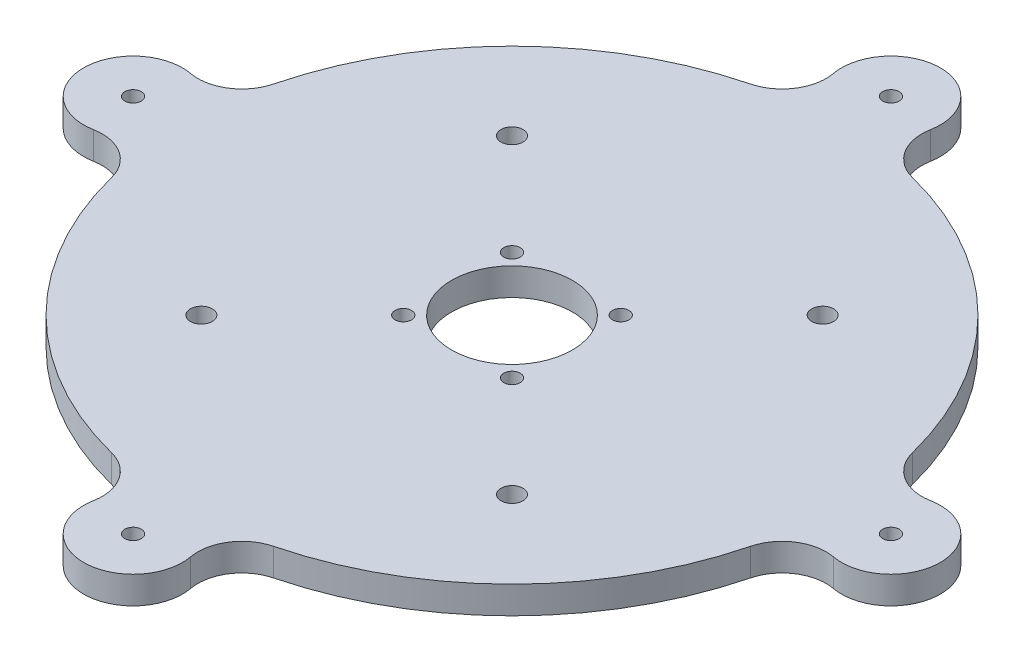
ISO-10303-21;
HEADER;
FILE_DESCRIPTION(('STEP AP214'),'2;1');
FILE_NAME('part.step','',(''),(''),'','','');
FILE_SCHEMA(('AUTOMOTIVE_DESIGN { 1 0 10303 214 1 1 1 1 }'));
ENDSEC;
DATA;
#1=APPLICATION_CONTEXT('core data for automotive mechanical design processes');
#2=APPLICATION_PROTOCOL_DEFINITION('international standard','automotive_design',2000,#1);
#3=PRODUCT_CONTEXT('',#1,'mechanical');
#4=PRODUCT('Part','Part','',(#3));
#5=PRODUCT_RELATED_PRODUCT_CATEGORY('part','',(#4));
#6=PRODUCT_DEFINITION_FORMATION('','',#4);
#7=PRODUCT_DEFINITION_CONTEXT('part definition',#1,'design');
#8=PRODUCT_DEFINITION('design','',#6,#7);
#9=PRODUCT_DEFINITION_SHAPE('','',#8);
#10=(LENGTH_UNIT() NAMED_UNIT(*) SI_UNIT(.MILLI.,.METRE.));
#11=(NAMED_UNIT(*) PLANE_ANGLE_UNIT() SI_UNIT($,.RADIAN.));
#12=(NAMED_UNIT(*) SI_UNIT($,.STERADIAN.) SOLID_ANGLE_UNIT());
#13=UNCERTAINTY_MEASURE_WITH_UNIT(LENGTH_MEASURE(1.E-05),#10,'distance_accuracy_value','');
#14=(GEOMETRIC_REPRESENTATION_CONTEXT(3) GLOBAL_UNCERTAINTY_ASSIGNED_CONTEXT((#13)) GLOBAL_UNIT_ASSIGNED_CONTEXT((#10,
#11,#12)) REPRESENTATION_CONTEXT('',''));
#15=CARTESIAN_POINT('',(0.,0.,0.));
#16=DIRECTION('',(0.,0.,1.));
#17=DIRECTION('',(1.,0.,0.));
#18=AXIS2_PLACEMENT_3D('',#15,#16,#17);
#19=CARTESIAN_POINT('',(16.7173771696678,5.,65.9130434782606));
#20=DIRECTION('',(0.,-1.,0.));
#21=DIRECTION('',(0.,0.,-1.));
#22=AXIS2_PLACEMENT_3D('',#19,#20,#21);
#23=CYLINDRICAL_SURFACE('',#22,7.99999999999999);
#24=CARTESIAN_POINT('',(16.7173771696678,0.,65.9130434782606));
#25=DIRECTION('',(0.,1.,0.));
#26=DIRECTION('',(0.,0.,1.));
#27=AXIS2_PLACEMENT_3D('',#24,#25,#26);
#28=CIRCLE('',#27,7.99999999999999);
#29=CARTESIAN_POINT('',(14.7506269144123,0.,58.1585677749359));
#30=VERTEX_POINT('',#29);
#31=CARTESIAN_POINT('',(8.85037614864767,0.,67.3657289002526));
#32=VERTEX_POINT('',#31);
#33=EDGE_CURVE('E218',#30,#32,#28,.T.);
#34=ORIENTED_EDGE('',*,*,#33,.F.);
#35=DIRECTION('',(0.,-1.,0.));
#36=VECTOR('',#35,1.);
#37=CARTESIAN_POINT('',(14.7506269144123,5.,58.1585677749359));
#38=LINE('',#37,#36);
#39=CARTESIAN_POINT('',(14.7506269144123,5.,58.1585677749359));
#40=VERTEX_POINT('',#39);
#41=EDGE_CURVE('E11',#40,#30,#38,.T.);
#42=ORIENTED_EDGE('',*,*,#41,.F.);
#43=CARTESIAN_POINT('',(16.7173771696678,5.,65.9130434782606));
#44=DIRECTION('',(0.,1.,0.));
#45=DIRECTION('',(0.,0.,1.));
#46=AXIS2_PLACEMENT_3D('',#43,#44,#45);
#47=CIRCLE('',#46,7.99999999999999);
#48=CARTESIAN_POINT('',(8.85037614864767,5.,67.3657289002526));
#49=VERTEX_POINT('',#48);
#50=EDGE_CURVE('E311',#40,#49,#47,.T.);
#51=ORIENTED_EDGE('',*,*,#50,.T.);
#52=DIRECTION('',(0.,-1.,0.));
#53=VECTOR('',#52,1.);
#54=CARTESIAN_POINT('',(8.85037614864767,5.,67.3657289002526));
#55=LINE('',#54,#53);
#56=EDGE_CURVE('E112',#49,#32,#55,.T.);
#57=ORIENTED_EDGE('',*,*,#56,.T.);
#58=EDGE_LOOP('',(#34,#42,#51,#57));
#59=FACE_BOUND('',#58,.T.);
#60=ADVANCED_FACE('F37',(#59),#23,.F.);
#61=CARTESIAN_POINT('',(0.,5.,0.));
#62=DIRECTION('',(0.,-1.,0.));
#63=DIRECTION('',(0.,0.,-1.));
#64=AXIS2_PLACEMENT_3D('',#61,#62,#63);
#65=CYLINDRICAL_SURFACE('',#64,60.);
#66=CARTESIAN_POINT('',(0.,0.,0.));
#67=DIRECTION('',(0.,1.,0.));
#68=DIRECTION('',(0.,0.,1.));
#69=AXIS2_PLACEMENT_3D('',#66,#67,#68);
#70=CIRCLE('',#69,60.);
#71=CARTESIAN_POINT('',(58.1585677749361,0.,14.7506269144118));
#72=VERTEX_POINT('',#71);
#73=EDGE_CURVE('E221',#30,#72,#70,.T.);
#74=ORIENTED_EDGE('',*,*,#73,.T.);
#75=DIRECTION('',(0.,-1.,0.));
#76=VECTOR('',#75,1.);
#77=CARTESIAN_POINT('',(58.1585677749361,5.,14.7506269144118));
#78=LINE('',#77,#76);
#79=CARTESIAN_POINT('',(58.1585677749361,5.,14.7506269144118));
#80=VERTEX_POINT('',#79);
#81=EDGE_CURVE('E46',#80,#72,#78,.T.);
#82=ORIENTED_EDGE('',*,*,#81,.F.);
#83=CARTESIAN_POINT('',(0.,5.,0.));
#84=DIRECTION('',(0.,1.,0.));
#85=DIRECTION('',(0.,0.,1.));
#86=AXIS2_PLACEMENT_3D('',#83,#84,#85);
#87=CIRCLE('',#86,60.);
#88=EDGE_CURVE('E309',#40,#80,#87,.T.);
#89=ORIENTED_EDGE('',*,*,#88,.F.);
#90=ORIENTED_EDGE('',*,*,#41,.T.);
#91=EDGE_LOOP('',(#74,#82,#89,#90));
#92=FACE_BOUND('',#91,.T.);
#93=ADVANCED_FACE('F294',(#92),#65,.T.);
#94=CARTESIAN_POINT('',(65.9130434782606,5.,16.7173771696678));
#95=DIRECTION('',(0.,-1.,0.));
#96=DIRECTION('',(0.,0.,-1.));
#97=AXIS2_PLACEMENT_3D('',#94,#95,#96);
#98=CYLINDRICAL_SURFACE('',#97,8.);
#99=CARTESIAN_POINT('',(65.9130434782606,0.,16.7173771696678));
#100=DIRECTION('',(0.,1.,0.));
#101=DIRECTION('',(0.,0.,1.));
#102=AXIS2_PLACEMENT_3D('',#99,#100,#101);
#103=CIRCLE('',#102,8.);
#104=CARTESIAN_POINT('',(67.3657289002527,0.,8.85037614864765));
#105=VERTEX_POINT('',#104);
#106=EDGE_CURVE('E224',#105,#72,#103,.T.);
#107=ORIENTED_EDGE('',*,*,#106,.F.);
#108=DIRECTION('',(0.,-1.,0.));
#109=VECTOR('',#108,1.);
#110=CARTESIAN_POINT('',(67.3657289002527,5.,8.85037614864765));
#111=LINE('',#110,#109);
#112=CARTESIAN_POINT('',(67.3657289002527,5.,8.85037614864765));
#113=VERTEX_POINT('',#112);
#114=EDGE_CURVE('E284',#113,#105,#111,.T.);
#115=ORIENTED_EDGE('',*,*,#114,.F.);
#116=CARTESIAN_POINT('',(65.9130434782606,5.,16.7173771696678));
#117=DIRECTION('',(0.,1.,0.));
#118=DIRECTION('',(0.,0.,1.));
#119=AXIS2_PLACEMENT_3D('',#116,#117,#118);
#120=CIRCLE('',#119,8.);
#121=EDGE_CURVE('E291',#113,#80,#120,.T.);
#122=ORIENTED_EDGE('',*,*,#121,.T.);
#123=ORIENTED_EDGE('',*,*,#81,.T.);
#124=EDGE_LOOP('',(#107,#115,#122,#123));
#125=FACE_BOUND('',#124,.T.);
#126=ADVANCED_FACE('F289',(#125),#98,.F.);
#127=CARTESIAN_POINT('',(68.9999999999937,5.,0.));
#128=DIRECTION('',(0.,-1.,0.));
#129=DIRECTION('',(0.,0.,-1.));
#130=AXIS2_PLACEMENT_3D('',#127,#128,#129);
#131=CYLINDRICAL_SURFACE('',#130,9.);
#132=CARTESIAN_POINT('',(68.9999999999937,0.,0.));
#133=DIRECTION('',(0.,1.,0.));
#134=DIRECTION('',(0.,0.,1.));
#135=AXIS2_PLACEMENT_3D('',#132,#133,#134);
#136=CIRCLE('',#135,9.);
#137=CARTESIAN_POINT('',(67.3657289002526,0.,-8.85037614864764));
#138=VERTEX_POINT('',#137);
#139=EDGE_CURVE('E227',#105,#138,#136,.T.);
#140=ORIENTED_EDGE('',*,*,#139,.T.);
#141=DIRECTION('',(0.,-1.,0.));
#142=VECTOR('',#141,1.);
#143=CARTESIAN_POINT('',(67.3657289002526,5.,-8.85037614864764));
#144=LINE('',#143,#142);
#145=CARTESIAN_POINT('',(67.3657289002526,5.,-8.85037614864764));
#146=VERTEX_POINT('',#145);
#147=EDGE_CURVE('E282',#146,#138,#144,.T.);
#148=ORIENTED_EDGE('',*,*,#147,.F.);
#149=CARTESIAN_POINT('',(68.9999999999937,5.,0.));
#150=DIRECTION('',(0.,1.,0.));
#151=DIRECTION('',(0.,0.,1.));
#152=AXIS2_PLACEMENT_3D('',#149,#150,#151);
#153=CIRCLE('',#152,9.);
#154=EDGE_CURVE('E305',#113,#146,#153,.T.);
#155=ORIENTED_EDGE('',*,*,#154,.F.);
#156=ORIENTED_EDGE('',*,*,#114,.T.);
#157=EDGE_LOOP('',(#140,#148,#155,#156));
#158=FACE_BOUND('',#157,.T.);
#159=ADVANCED_FACE('F302',(#158),#131,.T.);
#160=CARTESIAN_POINT('',(65.9130434782606,5.,-16.7173771696678));
#161=DIRECTION('',(0.,-1.,0.));
#162=DIRECTION('',(0.,0.,-1.));
#163=AXIS2_PLACEMENT_3D('',#160,#161,#162);
#164=CYLINDRICAL_SURFACE('',#163,7.99999999999999);
#165=CARTESIAN_POINT('',(65.9130434782606,0.,-16.7173771696678));
#166=DIRECTION('',(0.,1.,0.));
#167=DIRECTION('',(0.,0.,1.));
#168=AXIS2_PLACEMENT_3D('',#165,#166,#167);
#169=CIRCLE('',#168,7.99999999999999);
#170=CARTESIAN_POINT('',(58.1585677749359,0.,-14.7506269144123));
#171=VERTEX_POINT('',#170);
#172=EDGE_CURVE('E230',#171,#138,#169,.T.);
#173=ORIENTED_EDGE('',*,*,#172,.F.);
#174=DIRECTION('',(0.,-1.,0.));
#175=VECTOR('',#174,1.);
#176=CARTESIAN_POINT('',(58.1585677749359,5.,-14.7506269144123));
#177=LINE('',#176,#175);
#178=CARTESIAN_POINT('',(58.1585677749359,5.,-14.7506269144123));
#179=VERTEX_POINT('',#178);
#180=EDGE_CURVE('E280',#179,#171,#177,.T.);
#181=ORIENTED_EDGE('',*,*,#180,.F.);
#182=CARTESIAN_POINT('',(65.9130434782606,5.,-16.7173771696678));
#183=DIRECTION('',(0.,1.,0.));
#184=DIRECTION('',(0.,0.,1.));
#185=AXIS2_PLACEMENT_3D('',#182,#183,#184);
#186=CIRCLE('',#185,7.99999999999999);
#187=EDGE_CURVE('E307',#179,#146,#186,.T.);
#188=ORIENTED_EDGE('',*,*,#187,.T.);
#189=ORIENTED_EDGE('',*,*,#147,.T.);
#190=EDGE_LOOP('',(#173,#181,#188,#189));
#191=FACE_BOUND('',#190,.T.);
#192=ADVANCED_FACE('F544',(#191),#164,.F.);
#193=CARTESIAN_POINT('',(0.,5.,0.));
#194=DIRECTION('',(0.,-1.,0.));
#195=DIRECTION('',(0.,0.,-1.));
#196=AXIS2_PLACEMENT_3D('',#193,#194,#195);
#197=CYLINDRICAL_SURFACE('',#196,60.);
#198=CARTESIAN_POINT('',(0.,0.,0.));
#199=DIRECTION('',(0.,1.,0.));
#200=DIRECTION('',(0.,0.,1.));
#201=AXIS2_PLACEMENT_3D('',#198,#199,#200);
#202=CIRCLE('',#201,60.);
#203=CARTESIAN_POINT('',(14.7506269144124,0.,-58.1585677749359));
#204=VERTEX_POINT('',#203);
#205=EDGE_CURVE('E233',#171,#204,#202,.T.);
#206=ORIENTED_EDGE('',*,*,#205,.T.);
#207=DIRECTION('',(0.,-1.,0.));
#208=VECTOR('',#207,1.);
#209=CARTESIAN_POINT('',(14.7506269144124,5.,-58.1585677749359));
#210=LINE('',#209,#208);
#211=CARTESIAN_POINT('',(14.7506269144124,5.,-58.1585677749359));
#212=VERTEX_POINT('',#211);
#213=EDGE_CURVE('E278',#212,#204,#210,.T.);
#214=ORIENTED_EDGE('',*,*,#213,.F.);
#215=CARTESIAN_POINT('',(0.,5.,0.));
#216=DIRECTION('',(0.,1.,0.));
#217=DIRECTION('',(0.,0.,1.));
#218=AXIS2_PLACEMENT_3D('',#215,#216,#217);
#219=CIRCLE('',#218,60.);
#220=EDGE_CURVE('E316',#179,#212,#219,.T.);
#221=ORIENTED_EDGE('',*,*,#220,.F.);
#222=ORIENTED_EDGE('',*,*,#180,.T.);
#223=EDGE_LOOP('',(#206,#214,#221,#222));
#224=FACE_BOUND('',#223,.T.);
#225=ADVANCED_FACE('F540',(#224),#197,.T.);
#226=CARTESIAN_POINT('',(16.7173771696678,5.,-65.9130434782606));
#227=DIRECTION('',(0.,-1.,0.));
#228=DIRECTION('',(0.,0.,-1.));
#229=AXIS2_PLACEMENT_3D('',#226,#227,#228);
#230=CYLINDRICAL_SURFACE('',#229,8.00000000000001);
#231=CARTESIAN_POINT('',(16.7173771696678,0.,-65.9130434782606));
#232=DIRECTION('',(0.,1.,0.));
#233=DIRECTION('',(0.,0.,1.));
#234=AXIS2_PLACEMENT_3D('',#231,#232,#233);
#235=CIRCLE('',#234,8.00000000000001);
#236=CARTESIAN_POINT('',(8.85037614864764,0.,-67.3657289002526));
#237=VERTEX_POINT('',#236);
#238=EDGE_CURVE('E236',#237,#204,#235,.T.);
#239=ORIENTED_EDGE('',*,*,#238,.F.);
#240=DIRECTION('',(0.,-1.,0.));
#241=VECTOR('',#240,1.);
#242=CARTESIAN_POINT('',(8.85037614864764,5.,-67.3657289002526));
#243=LINE('',#242,#241);
#244=CARTESIAN_POINT('',(8.85037614864764,5.,-67.3657289002526));
#245=VERTEX_POINT('',#244);
#246=EDGE_CURVE('E276',#245,#237,#243,.T.);
#247=ORIENTED_EDGE('',*,*,#246,.F.);
#248=CARTESIAN_POINT('',(16.7173771696678,5.,-65.9130434782606));
#249=DIRECTION('',(0.,1.,0.));
#250=DIRECTION('',(0.,0.,1.));
#251=AXIS2_PLACEMENT_3D('',#248,#249,#250);
#252=CIRCLE('',#251,8.00000000000001);
#253=EDGE_CURVE('E318',#245,#212,#252,.T.);
#254=ORIENTED_EDGE('',*,*,#253,.T.);
#255=ORIENTED_EDGE('',*,*,#213,.T.);
#256=EDGE_LOOP('',(#239,#247,#254,#255));
#257=FACE_BOUND('',#256,.T.);
#258=ADVANCED_FACE('F536',(#257),#230,.F.);
#259=CARTESIAN_POINT('',(0.,5.,-68.9999999999937));
#260=DIRECTION('',(0.,-1.,0.));
#261=DIRECTION('',(0.,0.,-1.));
#262=AXIS2_PLACEMENT_3D('',#259,#260,#261);
#263=CYLINDRICAL_SURFACE('',#262,9.);
#264=CARTESIAN_POINT('',(0.,0.,-68.9999999999937));
#265=DIRECTION('',(0.,1.,0.));
#266=DIRECTION('',(0.,0.,1.));
#267=AXIS2_PLACEMENT_3D('',#264,#265,#266);
#268=CIRCLE('',#267,9.);
#269=CARTESIAN_POINT('',(-8.85037614864765,0.,-67.3657289002526));
#270=VERTEX_POINT('',#269);
#271=EDGE_CURVE('E239',#237,#270,#268,.T.);
#272=ORIENTED_EDGE('',*,*,#271,.T.);
#273=DIRECTION('',(0.,-1.,0.));
#274=VECTOR('',#273,1.);
#275=CARTESIAN_POINT('',(-8.85037614864765,5.,-67.3657289002526));
#276=LINE('',#275,#274);
#277=CARTESIAN_POINT('',(-8.85037614864765,5.,-67.3657289002526));
#278=VERTEX_POINT('',#277);
#279=EDGE_CURVE('E274',#278,#270,#276,.T.);
#280=ORIENTED_EDGE('',*,*,#279,.F.);
#281=CARTESIAN_POINT('',(0.,5.,-68.9999999999937));
#282=DIRECTION('',(0.,1.,0.));
#283=DIRECTION('',(0.,0.,1.));
#284=AXIS2_PLACEMENT_3D('',#281,#282,#283);
#285=CIRCLE('',#284,9.);
#286=EDGE_CURVE('E321',#245,#278,#285,.T.);
#287=ORIENTED_EDGE('',*,*,#286,.F.);
#288=ORIENTED_EDGE('',*,*,#246,.T.);
#289=EDGE_LOOP('',(#272,#280,#287,#288));
#290=FACE_BOUND('',#289,.T.);
#291=ADVANCED_FACE('F532',(#290),#263,.T.);
#292=CARTESIAN_POINT('',(-16.7173771696678,5.,-65.9130434782606));
#293=DIRECTION('',(0.,-1.,0.));
#294=DIRECTION('',(0.,0.,-1.));
#295=AXIS2_PLACEMENT_3D('',#292,#293,#294);
#296=CYLINDRICAL_SURFACE('',#295,7.99999999999998);
#297=CARTESIAN_POINT('',(-16.7173771696678,0.,-65.9130434782606));
#298=DIRECTION('',(0.,1.,0.));
#299=DIRECTION('',(0.,0.,1.));
#300=AXIS2_PLACEMENT_3D('',#297,#298,#299);
#301=CIRCLE('',#300,7.99999999999998);
#302=CARTESIAN_POINT('',(-14.7506269144123,0.,-58.1585677749359));
#303=VERTEX_POINT('',#302);
#304=EDGE_CURVE('E242',#303,#270,#301,.T.);
#305=ORIENTED_EDGE('',*,*,#304,.F.);
#306=DIRECTION('',(0.,-1.,0.));
#307=VECTOR('',#306,1.);
#308=CARTESIAN_POINT('',(-14.7506269144123,5.,-58.1585677749359));
#309=LINE('',#308,#307);
#310=CARTESIAN_POINT('',(-14.7506269144123,5.,-58.1585677749359));
#311=VERTEX_POINT('',#310);
#312=EDGE_CURVE('E272',#311,#303,#309,.T.);
#313=ORIENTED_EDGE('',*,*,#312,.F.);
#314=CARTESIAN_POINT('',(-16.7173771696678,5.,-65.9130434782606));
#315=DIRECTION('',(0.,1.,0.));
#316=DIRECTION('',(0.,0.,1.));
#317=AXIS2_PLACEMENT_3D('',#314,#315,#316);
#318=CIRCLE('',#317,7.99999999999998);
#319=EDGE_CURVE('E323',#311,#278,#318,.T.);
#320=ORIENTED_EDGE('',*,*,#319,.T.);
#321=ORIENTED_EDGE('',*,*,#279,.T.);
#322=EDGE_LOOP('',(#305,#313,#320,#321));
#323=FACE_BOUND('',#322,.T.);
#324=ADVANCED_FACE('F528',(#323),#296,.F.);
#325=CARTESIAN_POINT('',(0.,5.,0.));
#326=DIRECTION('',(0.,-1.,0.));
#327=DIRECTION('',(0.,0.,-1.));
#328=AXIS2_PLACEMENT_3D('',#325,#326,#327);
#329=CYLINDRICAL_SURFACE('',#328,60.);
#330=CARTESIAN_POINT('',(0.,0.,0.));
#331=DIRECTION('',(0.,1.,0.));
#332=DIRECTION('',(0.,0.,1.));
#333=AXIS2_PLACEMENT_3D('',#330,#331,#332);
#334=CIRCLE('',#333,60.);
#335=CARTESIAN_POINT('',(-58.158567774936,0.,-14.7506269144122));
#336=VERTEX_POINT('',#335);
#337=EDGE_CURVE('E245',#303,#336,#334,.T.);
#338=ORIENTED_EDGE('',*,*,#337,.T.);
#339=DIRECTION('',(0.,-1.,0.));
#340=VECTOR('',#339,1.);
#341=CARTESIAN_POINT('',(-58.158567774936,5.,-14.7506269144122));
#342=LINE('',#341,#340);
#343=CARTESIAN_POINT('',(-58.158567774936,5.,-14.7506269144122));
#344=VERTEX_POINT('',#343);
#345=EDGE_CURVE('E270',#344,#336,#342,.T.);
#346=ORIENTED_EDGE('',*,*,#345,.F.);
#347=CARTESIAN_POINT('',(0.,5.,0.));
#348=DIRECTION('',(0.,1.,0.));
#349=DIRECTION('',(0.,0.,1.));
#350=AXIS2_PLACEMENT_3D('',#347,#348,#349);
#351=CIRCLE('',#350,60.);
#352=EDGE_CURVE('E326',#311,#344,#351,.T.);
#353=ORIENTED_EDGE('',*,*,#352,.F.);
#354=ORIENTED_EDGE('',*,*,#312,.T.);
#355=EDGE_LOOP('',(#338,#346,#353,#354));
#356=FACE_BOUND('',#355,.T.);
#357=ADVANCED_FACE('F524',(#356),#329,.T.);
#358=CARTESIAN_POINT('',(-65.9130434782606,5.,-16.7173771696678));
#359=DIRECTION('',(0.,-1.,0.));
#360=DIRECTION('',(0.,0.,-1.));
#361=AXIS2_PLACEMENT_3D('',#358,#359,#360);
#362=CYLINDRICAL_SURFACE('',#361,7.99999999999999);
#363=CARTESIAN_POINT('',(-65.9130434782606,0.,-16.7173771696678));
#364=DIRECTION('',(0.,1.,0.));
#365=DIRECTION('',(0.,0.,1.));
#366=AXIS2_PLACEMENT_3D('',#363,#364,#365);
#367=CIRCLE('',#366,7.99999999999999);
#368=CARTESIAN_POINT('',(-67.3657289002526,0.,-8.85037614864764));
#369=VERTEX_POINT('',#368);
#370=EDGE_CURVE('E248',#369,#336,#367,.T.);
#371=ORIENTED_EDGE('',*,*,#370,.F.);
#372=DIRECTION('',(0.,-1.,0.));
#373=VECTOR('',#372,1.);
#374=CARTESIAN_POINT('',(-67.3657289002526,5.,-8.85037614864764));
#375=LINE('',#374,#373);
#376=CARTESIAN_POINT('',(-67.3657289002526,5.,-8.85037614864764));
#377=VERTEX_POINT('',#376);
#378=EDGE_CURVE('E268',#377,#369,#375,.T.);
#379=ORIENTED_EDGE('',*,*,#378,.F.);
#380=CARTESIAN_POINT('',(-65.9130434782606,5.,-16.7173771696678));
#381=DIRECTION('',(0.,1.,0.));
#382=DIRECTION('',(0.,0.,1.));
#383=AXIS2_PLACEMENT_3D('',#380,#381,#382);
#384=CIRCLE('',#383,7.99999999999999);
#385=EDGE_CURVE('E328',#377,#344,#384,.T.);
#386=ORIENTED_EDGE('',*,*,#385,.T.);
#387=ORIENTED_EDGE('',*,*,#345,.T.);
#388=EDGE_LOOP('',(#371,#379,#386,#387));
#389=FACE_BOUND('',#388,.T.);
#390=ADVANCED_FACE('F520',(#389),#362,.F.);
#391=CARTESIAN_POINT('',(-68.9999999999937,5.,0.));
#392=DIRECTION('',(0.,-1.,0.));
#393=DIRECTION('',(0.,0.,-1.));
#394=AXIS2_PLACEMENT_3D('',#391,#392,#393);
#395=CYLINDRICAL_SURFACE('',#394,9.);
#396=CARTESIAN_POINT('',(-68.9999999999937,0.,0.));
#397=DIRECTION('',(0.,1.,0.));
#398=DIRECTION('',(0.,0.,1.));
#399=AXIS2_PLACEMENT_3D('',#396,#397,#398);
#400=CIRCLE('',#399,9.);
#401=CARTESIAN_POINT('',(-67.3657289002526,0.,8.85037614864765));
#402=VERTEX_POINT('',#401);
#403=EDGE_CURVE('E251',#369,#402,#400,.T.);
#404=ORIENTED_EDGE('',*,*,#403,.T.);
#405=DIRECTION('',(0.,-1.,0.));
#406=VECTOR('',#405,1.);
#407=CARTESIAN_POINT('',(-67.3657289002526,5.,8.85037614864765));
#408=LINE('',#407,#406);
#409=CARTESIAN_POINT('',(-67.3657289002526,5.,8.85037614864765));
#410=VERTEX_POINT('',#409);
#411=EDGE_CURVE('E266',#410,#402,#408,.T.);
#412=ORIENTED_EDGE('',*,*,#411,.F.);
#413=CARTESIAN_POINT('',(-68.9999999999937,5.,0.));
#414=DIRECTION('',(0.,1.,0.));
#415=DIRECTION('',(0.,0.,1.));
#416=AXIS2_PLACEMENT_3D('',#413,#414,#415);
#417=CIRCLE('',#416,9.);
#418=EDGE_CURVE('E331',#377,#410,#417,.T.);
#419=ORIENTED_EDGE('',*,*,#418,.F.);
#420=ORIENTED_EDGE('',*,*,#378,.T.);
#421=EDGE_LOOP('',(#404,#412,#419,#420));
#422=FACE_BOUND('',#421,.T.);
#423=ADVANCED_FACE('F517',(#422),#395,.T.);
#424=CARTESIAN_POINT('',(-65.9130434782606,5.,16.7173771696678));
#425=DIRECTION('',(0.,-1.,0.));
#426=DIRECTION('',(0.,0.,-1.));
#427=AXIS2_PLACEMENT_3D('',#424,#425,#426);
#428=CYLINDRICAL_SURFACE('',#427,8.);
#429=CARTESIAN_POINT('',(-65.9130434782606,0.,16.7173771696678));
#430=DIRECTION('',(0.,1.,0.));
#431=DIRECTION('',(0.,0.,1.));
#432=AXIS2_PLACEMENT_3D('',#429,#430,#431);
#433=CIRCLE('',#432,8.);
#434=CARTESIAN_POINT('',(-58.1585677749359,0.,14.7506269144123));
#435=VERTEX_POINT('',#434);
#436=EDGE_CURVE('E254',#435,#402,#433,.T.);
#437=ORIENTED_EDGE('',*,*,#436,.F.);
#438=DIRECTION('',(0.,-1.,0.));
#439=VECTOR('',#438,1.);
#440=CARTESIAN_POINT('',(-58.1585677749359,5.,14.7506269144123));
#441=LINE('',#440,#439);
#442=CARTESIAN_POINT('',(-58.1585677749359,5.,14.7506269144123));
#443=VERTEX_POINT('',#442);
#444=EDGE_CURVE('E172',#443,#435,#441,.T.);
#445=ORIENTED_EDGE('',*,*,#444,.F.);
#446=CARTESIAN_POINT('',(-65.9130434782606,5.,16.7173771696678));
#447=DIRECTION('',(0.,1.,0.));
#448=DIRECTION('',(0.,0.,1.));
#449=AXIS2_PLACEMENT_3D('',#446,#447,#448);
#450=CIRCLE('',#449,8.);
#451=EDGE_CURVE('E161',#443,#410,#450,.T.);
#452=ORIENTED_EDGE('',*,*,#451,.T.);
#453=ORIENTED_EDGE('',*,*,#411,.T.);
#454=EDGE_LOOP('',(#437,#445,#452,#453));
#455=FACE_BOUND('',#454,.T.);
#456=ADVANCED_FACE('F334',(#455),#428,.F.);
#457=CARTESIAN_POINT('',(0.,5.,0.));
#458=DIRECTION('',(0.,-1.,0.));
#459=DIRECTION('',(0.,0.,-1.));
#460=AXIS2_PLACEMENT_3D('',#457,#458,#459);
#461=CYLINDRICAL_SURFACE('',#460,60.);
#462=CARTESIAN_POINT('',(0.,0.,0.));
#463=DIRECTION('',(0.,1.,0.));
#464=DIRECTION('',(0.,0.,1.));
#465=AXIS2_PLACEMENT_3D('',#462,#463,#464);
#466=CIRCLE('',#465,60.);
#467=CARTESIAN_POINT('',(-14.750626914412,0.,58.158567774936));
#468=VERTEX_POINT('',#467);
#469=EDGE_CURVE('E168',#435,#468,#466,.T.);
#470=ORIENTED_EDGE('',*,*,#469,.T.);
#471=DIRECTION('',(0.,-1.,0.));
#472=VECTOR('',#471,1.);
#473=CARTESIAN_POINT('',(-14.750626914412,5.,58.158567774936));
#474=LINE('',#473,#472);
#475=CARTESIAN_POINT('',(-14.750626914412,5.,58.158567774936));
#476=VERTEX_POINT('',#475);
#477=EDGE_CURVE('E165',#476,#468,#474,.T.);
#478=ORIENTED_EDGE('',*,*,#477,.F.);
#479=CARTESIAN_POINT('',(0.,5.,0.));
#480=DIRECTION('',(0.,1.,0.));
#481=DIRECTION('',(0.,0.,1.));
#482=AXIS2_PLACEMENT_3D('',#479,#480,#481);
#483=CIRCLE('',#482,60.);
#484=EDGE_CURVE('E155',#443,#476,#483,.T.);
#485=ORIENTED_EDGE('',*,*,#484,.F.);
#486=ORIENTED_EDGE('',*,*,#444,.T.);
#487=EDGE_LOOP('',(#470,#478,#485,#486));
#488=FACE_BOUND('',#487,.T.);
#489=ADVANCED_FACE('F166',(#488),#461,.T.);
#490=CARTESIAN_POINT('',(-16.7173771696678,5.,65.9130434782606));
#491=DIRECTION('',(0.,-1.,0.));
#492=DIRECTION('',(0.,0.,-1.));
#493=AXIS2_PLACEMENT_3D('',#490,#491,#492);
#494=CYLINDRICAL_SURFACE('',#493,8.00000000000001);
#495=CARTESIAN_POINT('',(-16.7173771696678,0.,65.9130434782606));
#496=DIRECTION('',(0.,1.,0.));
#497=DIRECTION('',(0.,0.,1.));
#498=AXIS2_PLACEMENT_3D('',#495,#496,#497);
#499=CIRCLE('',#498,8.00000000000001);
#500=CARTESIAN_POINT('',(-8.85037614864762,0.,67.3657289002526));
#501=VERTEX_POINT('',#500);
#502=EDGE_CURVE('E258',#501,#468,#499,.T.);
#503=ORIENTED_EDGE('',*,*,#502,.F.);
#504=DIRECTION('',(0.,-1.,0.));
#505=VECTOR('',#504,1.);
#506=CARTESIAN_POINT('',(-8.85037614864762,5.,67.3657289002526));
#507=LINE('',#506,#505);
#508=CARTESIAN_POINT('',(-8.85037614864762,5.,67.3657289002526));
#509=VERTEX_POINT('',#508);
#510=EDGE_CURVE('E105',#509,#501,#507,.T.);
#511=ORIENTED_EDGE('',*,*,#510,.F.);
#512=CARTESIAN_POINT('',(-16.7173771696678,5.,65.9130434782606));
#513=DIRECTION('',(0.,1.,0.));
#514=DIRECTION('',(0.,0.,1.));
#515=AXIS2_PLACEMENT_3D('',#512,#513,#514);
#516=CIRCLE('',#515,8.00000000000001);
#517=EDGE_CURVE('E159',#509,#476,#516,.T.);
#518=ORIENTED_EDGE('',*,*,#517,.T.);
#519=ORIENTED_EDGE('',*,*,#477,.T.);
#520=EDGE_LOOP('',(#503,#511,#518,#519));
#521=FACE_BOUND('',#520,.T.);
#522=ADVANCED_FACE('F174',(#521),#494,.F.);
#523=CARTESIAN_POINT('',(-28.2842712474619,5.,-28.2842712474618));
#524=DIRECTION('',(0.,-1.,0.));
#525=DIRECTION('',(0.,0.,-1.));
#526=AXIS2_PLACEMENT_3D('',#523,#524,#525);
#527=CYLINDRICAL_SURFACE('',#526,2.00000000000019);
#528=CARTESIAN_POINT('',(-28.2842712474619,5.,-28.2842712474618));
#529=DIRECTION('',(0.,1.,0.));
#530=DIRECTION('',(0.,0.,1.));
#531=AXIS2_PLACEMENT_3D('',#528,#529,#530);
#532=CIRCLE('',#531,2.00000000000019);
#533=CARTESIAN_POINT('',(-28.2842712474619,5.,-26.2842712474617));
#534=VERTEX_POINT('',#533);
#535=EDGE_CURVE('E338',#534,#534,#532,.T.);
#536=ORIENTED_EDGE('',*,*,#535,.T.);
#537=EDGE_LOOP('',(#536));
#538=FACE_BOUND('',#537,.T.);
#539=CARTESIAN_POINT('',(-28.2842712474619,0.,-28.2842712474618));
#540=DIRECTION('',(0.,1.,0.));
#541=DIRECTION('',(0.,0.,1.));
#542=AXIS2_PLACEMENT_3D('',#539,#540,#541);
#543=CIRCLE('',#542,2.00000000000019);
#544=CARTESIAN_POINT('',(-28.2842712474619,0.,-26.2842712474617));
#545=VERTEX_POINT('',#544);
#546=EDGE_CURVE('E215',#545,#545,#543,.T.);
#547=ORIENTED_EDGE('',*,*,#546,.F.);
#548=EDGE_LOOP('',(#547));
#549=FACE_BOUND('',#548,.T.);
#550=ADVANCED_FACE('F407',(#538,#549),#527,.F.);
#551=CARTESIAN_POINT('',(-28.2842712474619,5.,28.2842712474619));
#552=DIRECTION('',(0.,-1.,0.));
#553=DIRECTION('',(0.,0.,-1.));
#554=AXIS2_PLACEMENT_3D('',#551,#552,#553);
#555=CYLINDRICAL_SURFACE('',#554,2.00000000000009);
#556=CARTESIAN_POINT('',(-28.2842712474619,5.,28.2842712474619));
#557=DIRECTION('',(0.,1.,0.));
#558=DIRECTION('',(0.,0.,1.));
#559=AXIS2_PLACEMENT_3D('',#556,#557,#558);
#560=CIRCLE('',#559,2.00000000000009);
#561=CARTESIAN_POINT('',(-28.2842712474619,5.,30.284271247462));
#562=VERTEX_POINT('',#561);
#563=EDGE_CURVE('E340',#562,#562,#560,.T.);
#564=ORIENTED_EDGE('',*,*,#563,.T.);
#565=EDGE_LOOP('',(#564));
#566=FACE_BOUND('',#565,.T.);
#567=CARTESIAN_POINT('',(-28.2842712474619,0.,28.2842712474619));
#568=DIRECTION('',(0.,1.,0.));
#569=DIRECTION('',(0.,0.,1.));
#570=AXIS2_PLACEMENT_3D('',#567,#568,#569);
#571=CIRCLE('',#570,2.00000000000009);
#572=CARTESIAN_POINT('',(-28.2842712474619,0.,30.284271247462));
#573=VERTEX_POINT('',#572);
#574=EDGE_CURVE('E212',#573,#573,#571,.T.);
#575=ORIENTED_EDGE('',*,*,#574,.F.);
#576=EDGE_LOOP('',(#575));
#577=FACE_BOUND('',#576,.T.);
#578=ADVANCED_FACE('F410',(#566,#577),#555,.F.);
#579=CARTESIAN_POINT('',(28.2842712474619,5.,28.2842712474619));
#580=DIRECTION('',(0.,-1.,0.));
#581=DIRECTION('',(0.,0.,-1.));
#582=AXIS2_PLACEMENT_3D('',#579,#580,#581);
#583=CYLINDRICAL_SURFACE('',#582,2.);
#584=CARTESIAN_POINT('',(28.2842712474619,5.,28.2842712474619));
#585=DIRECTION('',(0.,1.,0.));
#586=DIRECTION('',(0.,0.,1.));
#587=AXIS2_PLACEMENT_3D('',#584,#585,#586);
#588=CIRCLE('',#587,2.);
#589=CARTESIAN_POINT('',(28.2842712474619,5.,30.2842712474619));
#590=VERTEX_POINT('',#589);
#591=EDGE_CURVE('E345',#590,#590,#588,.T.);
#592=ORIENTED_EDGE('',*,*,#591,.T.);
#593=EDGE_LOOP('',(#592));
#594=FACE_BOUND('',#593,.T.);
#595=CARTESIAN_POINT('',(28.2842712474619,0.,28.2842712474619));
#596=DIRECTION('',(0.,1.,0.));
#597=DIRECTION('',(0.,0.,1.));
#598=AXIS2_PLACEMENT_3D('',#595,#596,#597);
#599=CIRCLE('',#598,2.);
#600=CARTESIAN_POINT('',(28.2842712474619,0.,30.2842712474619));
#601=VERTEX_POINT('',#600);
#602=EDGE_CURVE('E209',#601,#601,#599,.T.);
#603=ORIENTED_EDGE('',*,*,#602,.F.);
#604=EDGE_LOOP('',(#603));
#605=FACE_BOUND('',#604,.T.);
#606=ADVANCED_FACE('F431',(#594,#605),#583,.F.);
#607=CARTESIAN_POINT('',(28.284271247462,5.,-28.2842712474619));
#608=DIRECTION('',(0.,-1.,0.));
#609=DIRECTION('',(0.,0.,-1.));
#610=AXIS2_PLACEMENT_3D('',#607,#608,#609);
#611=CYLINDRICAL_SURFACE('',#610,1.99999999999991);
#612=CARTESIAN_POINT('',(28.284271247462,5.,-28.2842712474619));
#613=DIRECTION('',(0.,1.,0.));
#614=DIRECTION('',(0.,0.,1.));
#615=AXIS2_PLACEMENT_3D('',#612,#613,#614);
#616=CIRCLE('',#615,1.99999999999991);
#617=CARTESIAN_POINT('',(28.284271247462,5.,-26.2842712474619));
#618=VERTEX_POINT('',#617);
#619=EDGE_CURVE('E348',#618,#618,#616,.T.);
#620=ORIENTED_EDGE('',*,*,#619,.T.);
#621=EDGE_LOOP('',(#620));
#622=FACE_BOUND('',#621,.T.);
#623=CARTESIAN_POINT('',(28.284271247462,0.,-28.2842712474619));
#624=DIRECTION('',(0.,1.,0.));
#625=DIRECTION('',(0.,0.,1.));
#626=AXIS2_PLACEMENT_3D('',#623,#624,#625);
#627=CIRCLE('',#626,1.99999999999991);
#628=CARTESIAN_POINT('',(28.284271247462,0.,-26.2842712474619));
#629=VERTEX_POINT('',#628);
#630=EDGE_CURVE('E206',#629,#629,#627,.T.);
#631=ORIENTED_EDGE('',*,*,#630,.F.);
#632=EDGE_LOOP('',(#631));
#633=FACE_BOUND('',#632,.T.);
#634=ADVANCED_FACE('F435',(#622,#633),#611,.F.);
#635=CARTESIAN_POINT('',(-9.89949493661168,5.,-9.89949493661165));
#636=DIRECTION('',(0.,-1.,0.));
#637=DIRECTION('',(0.,0.,-1.));
#638=AXIS2_PLACEMENT_3D('',#635,#636,#637);
#639=CYLINDRICAL_SURFACE('',#638,1.50000000000006);
#640=CARTESIAN_POINT('',(-9.89949493661168,5.,-9.89949493661165));
#641=DIRECTION('',(0.,1.,0.));
#642=DIRECTION('',(0.,0.,1.));
#643=AXIS2_PLACEMENT_3D('',#640,#641,#642);
#644=CIRCLE('',#643,1.50000000000006);
#645=CARTESIAN_POINT('',(-9.89949493661168,5.,-8.39949493661158));
#646=VERTEX_POINT('',#645);
#647=EDGE_CURVE('E351',#646,#646,#644,.T.);
#648=ORIENTED_EDGE('',*,*,#647,.T.);
#649=EDGE_LOOP('',(#648));
#650=FACE_BOUND('',#649,.T.);
#651=CARTESIAN_POINT('',(-9.89949493661168,0.,-9.89949493661165));
#652=DIRECTION('',(0.,1.,0.));
#653=DIRECTION('',(0.,0.,1.));
#654=AXIS2_PLACEMENT_3D('',#651,#652,#653);
#655=CIRCLE('',#654,1.50000000000006);
#656=CARTESIAN_POINT('',(-9.89949493661168,0.,-8.39949493661158));
#657=VERTEX_POINT('',#656);
#658=EDGE_CURVE('E203',#657,#657,#655,.T.);
#659=ORIENTED_EDGE('',*,*,#658,.F.);
#660=EDGE_LOOP('',(#659));
#661=FACE_BOUND('',#660,.T.);
#662=ADVANCED_FACE('F439',(#650,#661),#639,.F.);
#663=CARTESIAN_POINT('',(-9.89949493661164,5.,9.89949493661168));
#664=DIRECTION('',(0.,-1.,0.));
#665=DIRECTION('',(0.,0.,-1.));
#666=AXIS2_PLACEMENT_3D('',#663,#664,#665);
#667=CYLINDRICAL_SURFACE('',#666,1.50000000000004);
#668=CARTESIAN_POINT('',(-9.89949493661164,5.,9.89949493661168));
#669=DIRECTION('',(0.,1.,0.));
#670=DIRECTION('',(0.,0.,1.));
#671=AXIS2_PLACEMENT_3D('',#668,#669,#670);
#672=CIRCLE('',#671,1.50000000000004);
#673=CARTESIAN_POINT('',(-9.89949493661164,5.,11.3994949366117));
#674=VERTEX_POINT('',#673);
#675=EDGE_CURVE('E354',#674,#674,#672,.T.);
#676=ORIENTED_EDGE('',*,*,#675,.T.);
#677=EDGE_LOOP('',(#676));
#678=FACE_BOUND('',#677,.T.);
#679=CARTESIAN_POINT('',(-9.89949493661164,0.,9.89949493661168));
#680=DIRECTION('',(0.,1.,0.));
#681=DIRECTION('',(0.,0.,1.));
#682=AXIS2_PLACEMENT_3D('',#679,#680,#681);
#683=CIRCLE('',#682,1.50000000000004);
#684=CARTESIAN_POINT('',(-9.89949493661164,0.,11.3994949366117));
#685=VERTEX_POINT('',#684);
#686=EDGE_CURVE('E200',#685,#685,#683,.T.);
#687=ORIENTED_EDGE('',*,*,#686,.F.);
#688=EDGE_LOOP('',(#687));
#689=FACE_BOUND('',#688,.T.);
#690=ADVANCED_FACE('F443',(#678,#689),#667,.F.);
#691=CARTESIAN_POINT('',(9.89949493661165,5.,9.89949493661168));
#692=DIRECTION('',(0.,-1.,0.));
#693=DIRECTION('',(0.,0.,-1.));
#694=AXIS2_PLACEMENT_3D('',#691,#692,#693);
#695=CYLINDRICAL_SURFACE('',#694,1.5);
#696=CARTESIAN_POINT('',(9.89949493661165,5.,9.89949493661168));
#697=DIRECTION('',(0.,1.,0.));
#698=DIRECTION('',(0.,0.,1.));
#699=AXIS2_PLACEMENT_3D('',#696,#697,#698);
#700=CIRCLE('',#699,1.5);
#701=CARTESIAN_POINT('',(9.89949493661165,5.,11.3994949366117));
#702=VERTEX_POINT('',#701);
#703=EDGE_CURVE('E357',#702,#702,#700,.T.);
#704=ORIENTED_EDGE('',*,*,#703,.T.);
#705=EDGE_LOOP('',(#704));
#706=FACE_BOUND('',#705,.T.);
#707=CARTESIAN_POINT('',(9.89949493661165,0.,9.89949493661168));
#708=DIRECTION('',(0.,1.,0.));
#709=DIRECTION('',(0.,0.,1.));
#710=AXIS2_PLACEMENT_3D('',#707,#708,#709);
#711=CIRCLE('',#710,1.5);
#712=CARTESIAN_POINT('',(9.89949493661165,0.,11.3994949366117));
#713=VERTEX_POINT('',#712);
#714=EDGE_CURVE('E197',#713,#713,#711,.T.);
#715=ORIENTED_EDGE('',*,*,#714,.F.);
#716=EDGE_LOOP('',(#715));
#717=FACE_BOUND('',#716,.T.);
#718=ADVANCED_FACE('F447',(#706,#717),#695,.F.);
#719=CARTESIAN_POINT('',(9.89949493661174,5.,-9.89949493661161));
#720=DIRECTION('',(0.,-1.,0.));
#721=DIRECTION('',(0.,0.,-1.));
#722=AXIS2_PLACEMENT_3D('',#719,#720,#721);
#723=CYLINDRICAL_SURFACE('',#722,1.49999999999993);
#724=CARTESIAN_POINT('',(9.89949493661174,5.,-9.89949493661161));
#725=DIRECTION('',(0.,1.,0.));
#726=DIRECTION('',(0.,0.,1.));
#727=AXIS2_PLACEMENT_3D('',#724,#725,#726);
#728=CIRCLE('',#727,1.49999999999993);
#729=CARTESIAN_POINT('',(9.89949493661174,5.,-8.39949493661168));
#730=VERTEX_POINT('',#729);
#731=EDGE_CURVE('E360',#730,#730,#728,.T.);
#732=ORIENTED_EDGE('',*,*,#731,.T.);
#733=EDGE_LOOP('',(#732));
#734=FACE_BOUND('',#733,.T.);
#735=CARTESIAN_POINT('',(9.89949493661174,0.,-9.89949493661161));
#736=DIRECTION('',(0.,1.,0.));
#737=DIRECTION('',(0.,0.,1.));
#738=AXIS2_PLACEMENT_3D('',#735,#736,#737);
#739=CIRCLE('',#738,1.49999999999993);
#740=CARTESIAN_POINT('',(9.89949493661174,0.,-8.39949493661168));
#741=VERTEX_POINT('',#740);
#742=EDGE_CURVE('E194',#741,#741,#739,.T.);
#743=ORIENTED_EDGE('',*,*,#742,.F.);
#744=EDGE_LOOP('',(#743));
#745=FACE_BOUND('',#744,.T.);
#746=ADVANCED_FACE('F451',(#734,#745),#723,.F.);
#747=CARTESIAN_POINT('',(0.,5.,0.));
#748=DIRECTION('',(0.,-1.,0.));
#749=DIRECTION('',(0.,0.,-1.));
#750=AXIS2_PLACEMENT_3D('',#747,#748,#749);
#751=CYLINDRICAL_SURFACE('',#750,11.);
#752=CARTESIAN_POINT('',(0.,5.,0.));
#753=DIRECTION('',(0.,1.,0.));
#754=DIRECTION('',(0.,0.,1.));
#755=AXIS2_PLACEMENT_3D('',#752,#753,#754);
#756=CIRCLE('',#755,11.);
#757=CARTESIAN_POINT('',(0.,5.,11.));
#758=VERTEX_POINT('',#757);
#759=EDGE_CURVE('E363',#758,#758,#756,.T.);
#760=ORIENTED_EDGE('',*,*,#759,.T.);
#761=EDGE_LOOP('',(#760));
#762=FACE_BOUND('',#761,.T.);
#763=CARTESIAN_POINT('',(0.,0.,0.));
#764=DIRECTION('',(0.,1.,0.));
#765=DIRECTION('',(0.,0.,1.));
#766=AXIS2_PLACEMENT_3D('',#763,#764,#765);
#767=CIRCLE('',#766,11.);
#768=CARTESIAN_POINT('',(0.,0.,11.));
#769=VERTEX_POINT('',#768);
#770=EDGE_CURVE('E191',#769,#769,#767,.T.);
#771=ORIENTED_EDGE('',*,*,#770,.F.);
#772=EDGE_LOOP('',(#771));
#773=FACE_BOUND('',#772,.T.);
#774=ADVANCED_FACE('F455',(#762,#773),#751,.F.);
#775=CARTESIAN_POINT('',(68.9999999999937,5.,0.));
#776=DIRECTION('',(0.,-1.,0.));
#777=DIRECTION('',(0.,0.,-1.));
#778=AXIS2_PLACEMENT_3D('',#775,#776,#777);
#779=CYLINDRICAL_SURFACE('',#778,1.50000000000343);
#780=CARTESIAN_POINT('',(68.9999999999937,5.,0.));
#781=DIRECTION('',(0.,1.,0.));
#782=DIRECTION('',(0.,0.,1.));
#783=AXIS2_PLACEMENT_3D('',#780,#781,#782);
#784=CIRCLE('',#783,1.50000000000343);
#785=CARTESIAN_POINT('',(68.9999999999937,5.,1.50000000000344));
#786=VERTEX_POINT('',#785);
#787=EDGE_CURVE('E366',#786,#786,#784,.T.);
#788=ORIENTED_EDGE('',*,*,#787,.T.);
#789=EDGE_LOOP('',(#788));
#790=FACE_BOUND('',#789,.T.);
#791=CARTESIAN_POINT('',(68.9999999999937,0.,0.));
#792=DIRECTION('',(0.,1.,0.));
#793=DIRECTION('',(0.,0.,1.));
#794=AXIS2_PLACEMENT_3D('',#791,#792,#793);
#795=CIRCLE('',#794,1.50000000000343);
#796=CARTESIAN_POINT('',(68.9999999999937,0.,1.50000000000344));
#797=VERTEX_POINT('',#796);
#798=EDGE_CURVE('E188',#797,#797,#795,.T.);
#799=ORIENTED_EDGE('',*,*,#798,.F.);
#800=EDGE_LOOP('',(#799));
#801=FACE_BOUND('',#800,.T.);
#802=ADVANCED_FACE('F459',(#790,#801),#779,.F.);
#803=CARTESIAN_POINT('',(0.,5.,-68.9999999999937));
#804=DIRECTION('',(0.,-1.,0.));
#805=DIRECTION('',(0.,0.,-1.));
#806=AXIS2_PLACEMENT_3D('',#803,#804,#805);
#807=CYLINDRICAL_SURFACE('',#806,1.5000000000008);
#808=CARTESIAN_POINT('',(0.,5.,-68.9999999999937));
#809=DIRECTION('',(0.,1.,0.));
#810=DIRECTION('',(0.,0.,1.));
#811=AXIS2_PLACEMENT_3D('',#808,#809,#810);
#812=CIRCLE('',#811,1.5000000000008);
#813=CARTESIAN_POINT('',(0.,5.,-67.4999999999929));
#814=VERTEX_POINT('',#813);
#815=EDGE_CURVE('E369',#814,#814,#812,.T.);
#816=ORIENTED_EDGE('',*,*,#815,.T.);
#817=EDGE_LOOP('',(#816));
#818=FACE_BOUND('',#817,.T.);
#819=CARTESIAN_POINT('',(0.,0.,-68.9999999999937));
#820=DIRECTION('',(0.,1.,0.));
#821=DIRECTION('',(0.,0.,1.));
#822=AXIS2_PLACEMENT_3D('',#819,#820,#821);
#823=CIRCLE('',#822,1.5000000000008);
#824=CARTESIAN_POINT('',(0.,0.,-67.4999999999929));
#825=VERTEX_POINT('',#824);
#826=EDGE_CURVE('E185',#825,#825,#823,.T.);
#827=ORIENTED_EDGE('',*,*,#826,.F.);
#828=EDGE_LOOP('',(#827));
#829=FACE_BOUND('',#828,.T.);
#830=ADVANCED_FACE('F463',(#818,#829),#807,.F.);
#831=CARTESIAN_POINT('',(-68.9999999999937,5.,0.));
#832=DIRECTION('',(0.,-1.,0.));
#833=DIRECTION('',(0.,0.,-1.));
#834=AXIS2_PLACEMENT_3D('',#831,#832,#833);
#835=CYLINDRICAL_SURFACE('',#834,1.49999999999745);
#836=CARTESIAN_POINT('',(-68.9999999999937,5.,0.));
#837=DIRECTION('',(0.,1.,0.));
#838=DIRECTION('',(0.,0.,1.));
#839=AXIS2_PLACEMENT_3D('',#836,#837,#838);
#840=CIRCLE('',#839,1.49999999999745);
#841=CARTESIAN_POINT('',(-68.9999999999937,5.,1.49999999999746));
#842=VERTEX_POINT('',#841);
#843=EDGE_CURVE('E372',#842,#842,#840,.T.);
#844=ORIENTED_EDGE('',*,*,#843,.T.);
#845=EDGE_LOOP('',(#844));
#846=FACE_BOUND('',#845,.T.);
#847=CARTESIAN_POINT('',(-68.9999999999937,0.,0.));
#848=DIRECTION('',(0.,1.,0.));
#849=DIRECTION('',(0.,0.,1.));
#850=AXIS2_PLACEMENT_3D('',#847,#848,#849);
#851=CIRCLE('',#850,1.49999999999745);
#852=CARTESIAN_POINT('',(-68.9999999999937,0.,1.49999999999746));
#853=VERTEX_POINT('',#852);
#854=EDGE_CURVE('E182',#853,#853,#851,.T.);
#855=ORIENTED_EDGE('',*,*,#854,.F.);
#856=EDGE_LOOP('',(#855));
#857=FACE_BOUND('',#856,.T.);
#858=ADVANCED_FACE('F466',(#846,#857),#835,.F.);
#859=CARTESIAN_POINT('',(0.,5.,68.9999999999937));
#860=DIRECTION('',(0.,-1.,0.));
#861=DIRECTION('',(0.,0.,-1.));
#862=AXIS2_PLACEMENT_3D('',#859,#860,#861);
#863=CYLINDRICAL_SURFACE('',#862,1.49999999999922);
#864=CARTESIAN_POINT('',(0.,5.,68.9999999999937));
#865=DIRECTION('',(0.,1.,0.));
#866=DIRECTION('',(0.,0.,1.));
#867=AXIS2_PLACEMENT_3D('',#864,#865,#866);
#868=CIRCLE('',#867,1.49999999999922);
#869=CARTESIAN_POINT('',(0.,5.,70.4999999999929));
#870=VERTEX_POINT('',#869);
#871=EDGE_CURVE('E262',#870,#870,#868,.T.);
#872=ORIENTED_EDGE('',*,*,#871,.T.);
#873=EDGE_LOOP('',(#872));
#874=FACE_BOUND('',#873,.T.);
#875=CARTESIAN_POINT('',(0.,0.,68.9999999999937));
#876=DIRECTION('',(0.,1.,0.));
#877=DIRECTION('',(0.,0.,1.));
#878=AXIS2_PLACEMENT_3D('',#875,#876,#877);
#879=CIRCLE('',#878,1.49999999999922);
#880=CARTESIAN_POINT('',(0.,0.,70.4999999999929));
#881=VERTEX_POINT('',#880);
#882=EDGE_CURVE('E179',#881,#881,#879,.T.);
#883=ORIENTED_EDGE('',*,*,#882,.F.);
#884=EDGE_LOOP('',(#883));
#885=FACE_BOUND('',#884,.T.);
#886=ADVANCED_FACE('F39',(#874,#885),#863,.F.);
#887=CARTESIAN_POINT('',(0.,5.,68.9999999999937));
#888=DIRECTION('',(0.,-1.,0.));
#889=DIRECTION('',(0.,0.,-1.));
#890=AXIS2_PLACEMENT_3D('',#887,#888,#889);
#891=CYLINDRICAL_SURFACE('',#890,9.);
#892=CARTESIAN_POINT('',(0.,0.,68.9999999999937));
#893=DIRECTION('',(0.,1.,0.));
#894=DIRECTION('',(0.,0.,1.));
#895=AXIS2_PLACEMENT_3D('',#892,#893,#894);
#896=CIRCLE('',#895,9.);
#897=EDGE_CURVE('E260',#501,#32,#896,.T.);
#898=ORIENTED_EDGE('',*,*,#897,.T.);
#899=ORIENTED_EDGE('',*,*,#56,.F.);
#900=CARTESIAN_POINT('',(0.,5.,68.9999999999937));
#901=DIRECTION('',(0.,1.,0.));
#902=DIRECTION('',(0.,0.,1.));
#903=AXIS2_PLACEMENT_3D('',#900,#901,#902);
#904=CIRCLE('',#903,9.);
#905=EDGE_CURVE('E54',#509,#49,#904,.T.);
#906=ORIENTED_EDGE('',*,*,#905,.F.);
#907=ORIENTED_EDGE('',*,*,#510,.T.);
#908=EDGE_LOOP('',(#898,#899,#906,#907));
#909=FACE_BOUND('',#908,.T.);
#910=ADVANCED_FACE('F337',(#909),#891,.T.);
#911=CARTESIAN_POINT('',(0.,5.,0.));
#912=DIRECTION('',(0.,1.,0.));
#913=DIRECTION('',(0.,0.,1.));
#914=AXIS2_PLACEMENT_3D('',#911,#912,#913);
#915=PLANE('',#914);
#916=ORIENTED_EDGE('',*,*,#871,.F.);
#917=EDGE_LOOP('',(#916));
#918=FACE_BOUND('',#917,.T.);
#919=ORIENTED_EDGE('',*,*,#843,.F.);
#920=EDGE_LOOP('',(#919));
#921=FACE_BOUND('',#920,.T.);
#922=ORIENTED_EDGE('',*,*,#815,.F.);
#923=EDGE_LOOP('',(#922));
#924=FACE_BOUND('',#923,.T.);
#925=ORIENTED_EDGE('',*,*,#787,.F.);
#926=EDGE_LOOP('',(#925));
#927=FACE_BOUND('',#926,.T.);
#928=ORIENTED_EDGE('',*,*,#759,.F.);
#929=EDGE_LOOP('',(#928));
#930=FACE_BOUND('',#929,.T.);
#931=ORIENTED_EDGE('',*,*,#731,.F.);
#932=EDGE_LOOP('',(#931));
#933=FACE_BOUND('',#932,.T.);
#934=ORIENTED_EDGE('',*,*,#703,.F.);
#935=EDGE_LOOP('',(#934));
#936=FACE_BOUND('',#935,.T.);
#937=ORIENTED_EDGE('',*,*,#675,.F.);
#938=EDGE_LOOP('',(#937));
#939=FACE_BOUND('',#938,.T.);
#940=ORIENTED_EDGE('',*,*,#647,.F.);
#941=EDGE_LOOP('',(#940));
#942=FACE_BOUND('',#941,.T.);
#943=ORIENTED_EDGE('',*,*,#619,.F.);
#944=EDGE_LOOP('',(#943));
#945=FACE_BOUND('',#944,.T.);
#946=ORIENTED_EDGE('',*,*,#591,.F.);
#947=EDGE_LOOP('',(#946));
#948=FACE_BOUND('',#947,.T.);
#949=ORIENTED_EDGE('',*,*,#563,.F.);
#950=EDGE_LOOP('',(#949));
#951=FACE_BOUND('',#950,.T.);
#952=ORIENTED_EDGE('',*,*,#535,.F.);
#953=EDGE_LOOP('',(#952));
#954=FACE_BOUND('',#953,.T.);
#955=ORIENTED_EDGE('',*,*,#50,.F.);
#956=ORIENTED_EDGE('',*,*,#88,.T.);
#957=ORIENTED_EDGE('',*,*,#121,.F.);
#958=ORIENTED_EDGE('',*,*,#154,.T.);
#959=ORIENTED_EDGE('',*,*,#187,.F.);
#960=ORIENTED_EDGE('',*,*,#220,.T.);
#961=ORIENTED_EDGE('',*,*,#253,.F.);
#962=ORIENTED_EDGE('',*,*,#286,.T.);
#963=ORIENTED_EDGE('',*,*,#319,.F.);
#964=ORIENTED_EDGE('',*,*,#352,.T.);
#965=ORIENTED_EDGE('',*,*,#385,.F.);
#966=ORIENTED_EDGE('',*,*,#418,.T.);
#967=ORIENTED_EDGE('',*,*,#451,.F.);
#968=ORIENTED_EDGE('',*,*,#484,.T.);
#969=ORIENTED_EDGE('',*,*,#517,.F.);
#970=ORIENTED_EDGE('',*,*,#905,.T.);
#971=EDGE_LOOP('',(#955,#956,#957,#958,#959,#960,#961,#962,#963,#964,#965,#966,#967,#968,#969,#970));
#972=FACE_BOUND('',#971,.T.);
#973=ADVANCED_FACE('F157',(#918,#921,#924,#927,#930,#933,#936,#939,#942,#945,#948,#951,#954,
#972),#915,.T.);
#974=CARTESIAN_POINT('',(0.,0.,0.));
#975=DIRECTION('',(0.,1.,0.));
#976=DIRECTION('',(0.,0.,1.));
#977=AXIS2_PLACEMENT_3D('',#974,#975,#976);
#978=PLANE('',#977);
#979=ORIENTED_EDGE('',*,*,#882,.T.);
#980=EDGE_LOOP('',(#979));
#981=FACE_BOUND('',#980,.T.);
#982=ORIENTED_EDGE('',*,*,#854,.T.);
#983=EDGE_LOOP('',(#982));
#984=FACE_BOUND('',#983,.T.);
#985=ORIENTED_EDGE('',*,*,#826,.T.);
#986=EDGE_LOOP('',(#985));
#987=FACE_BOUND('',#986,.T.);
#988=ORIENTED_EDGE('',*,*,#798,.T.);
#989=EDGE_LOOP('',(#988));
#990=FACE_BOUND('',#989,.T.);
#991=ORIENTED_EDGE('',*,*,#770,.T.);
#992=EDGE_LOOP('',(#991));
#993=FACE_BOUND('',#992,.T.);
#994=ORIENTED_EDGE('',*,*,#742,.T.);
#995=EDGE_LOOP('',(#994));
#996=FACE_BOUND('',#995,.T.);
#997=ORIENTED_EDGE('',*,*,#714,.T.);
#998=EDGE_LOOP('',(#997));
#999=FACE_BOUND('',#998,.T.);
#1000=ORIENTED_EDGE('',*,*,#686,.T.);
#1001=EDGE_LOOP('',(#1000));
#1002=FACE_BOUND('',#1001,.T.);
#1003=ORIENTED_EDGE('',*,*,#658,.T.);
#1004=EDGE_LOOP('',(#1003));
#1005=FACE_BOUND('',#1004,.T.);
#1006=ORIENTED_EDGE('',*,*,#630,.T.);
#1007=EDGE_LOOP('',(#1006));
#1008=FACE_BOUND('',#1007,.T.);
#1009=ORIENTED_EDGE('',*,*,#602,.T.);
#1010=EDGE_LOOP('',(#1009));
#1011=FACE_BOUND('',#1010,.T.);
#1012=ORIENTED_EDGE('',*,*,#574,.T.);
#1013=EDGE_LOOP('',(#1012));
#1014=FACE_BOUND('',#1013,.T.);
#1015=ORIENTED_EDGE('',*,*,#546,.T.);
#1016=EDGE_LOOP('',(#1015));
#1017=FACE_BOUND('',#1016,.T.);
#1018=ORIENTED_EDGE('',*,*,#33,.T.);
#1019=ORIENTED_EDGE('',*,*,#897,.F.);
#1020=ORIENTED_EDGE('',*,*,#502,.T.);
#1021=ORIENTED_EDGE('',*,*,#469,.F.);
#1022=ORIENTED_EDGE('',*,*,#436,.T.);
#1023=ORIENTED_EDGE('',*,*,#403,.F.);
#1024=ORIENTED_EDGE('',*,*,#370,.T.);
#1025=ORIENTED_EDGE('',*,*,#337,.F.);
#1026=ORIENTED_EDGE('',*,*,#304,.T.);
#1027=ORIENTED_EDGE('',*,*,#271,.F.);
#1028=ORIENTED_EDGE('',*,*,#238,.T.);
#1029=ORIENTED_EDGE('',*,*,#205,.F.);
#1030=ORIENTED_EDGE('',*,*,#172,.T.);
#1031=ORIENTED_EDGE('',*,*,#139,.F.);
#1032=ORIENTED_EDGE('',*,*,#106,.T.);
#1033=ORIENTED_EDGE('',*,*,#73,.F.);
#1034=EDGE_LOOP('',(#1018,#1019,#1020,#1021,#1022,#1023,#1024,#1025,#1026,#1027,#1028,#1029,
#1030,#1031,#1032,#1033));
#1035=FACE_BOUND('',#1034,.T.);
#1036=ADVANCED_FACE('F297',(#981,#984,#987,#990,#993,#996,#999,#1002,#1005,#1008,#1011,#1014,
#1017,#1035),#978,.F.);
#1037=CLOSED_SHELL('',(#60,#93,#126,#159,#192,#225,#258,#291,#324,#357,#390,#423,#456,#489,#522,
#550,#578,#606,#634,#662,#690,#718,#746,#774,#802,#830,#858,#886,#910,#973,#1036));
#1038=MANIFOLD_SOLID_BREP('B2',#1037);
#1039=ADVANCED_BREP_SHAPE_REPRESENTATION('',(#18,#1038),#14);
#1040=SHAPE_DEFINITION_REPRESENTATION(#9,#1039);
ENDSEC;
END-ISO-10303-21;
